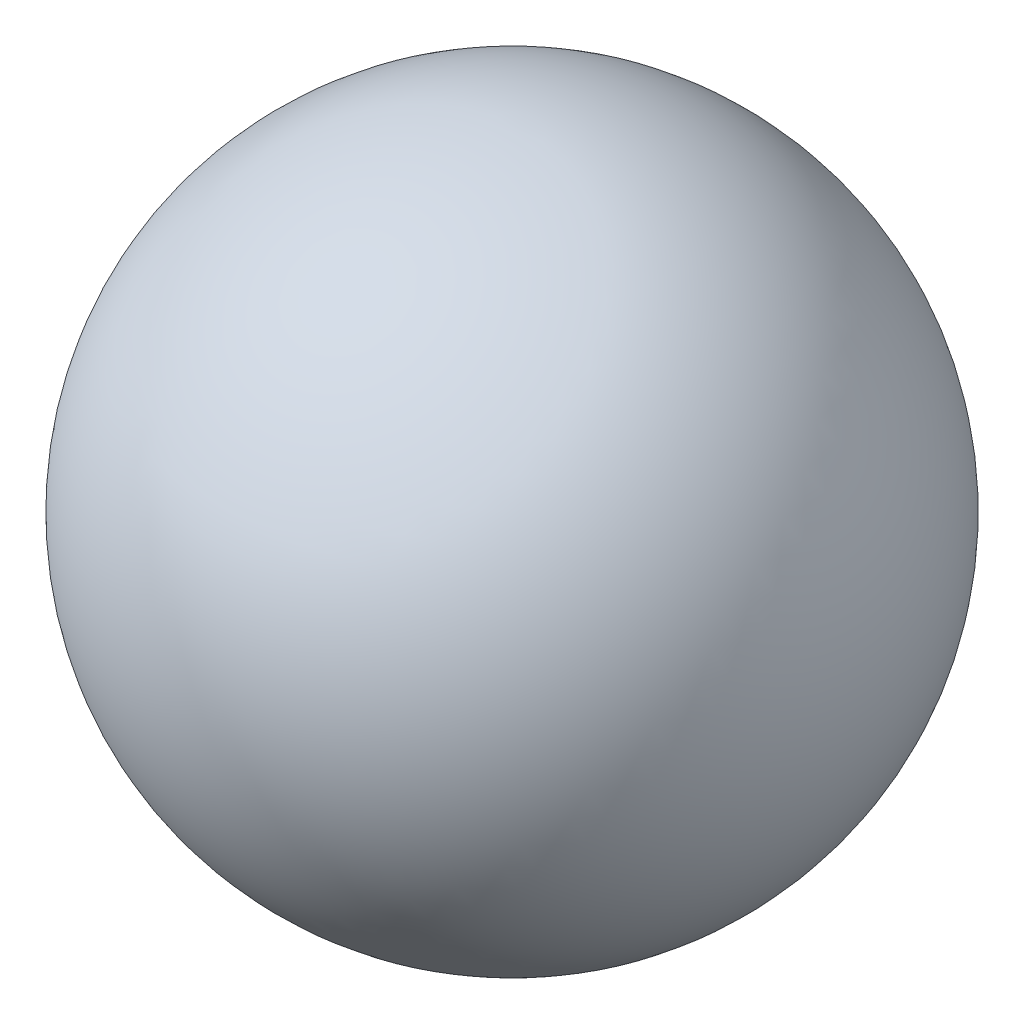
ISO-10303-21;
HEADER;
FILE_DESCRIPTION(('STEP AP214'),'2;1');
FILE_NAME('part.step','',(''),(''),'','','');
FILE_SCHEMA(('AUTOMOTIVE_DESIGN { 1 0 10303 214 1 1 1 1 }'));
ENDSEC;
DATA;
#1=APPLICATION_CONTEXT('core data for automotive mechanical design processes');
#2=APPLICATION_PROTOCOL_DEFINITION('international standard','automotive_design',2000,#1);
#3=PRODUCT_CONTEXT('',#1,'mechanical');
#4=PRODUCT('Part','Part','',(#3));
#5=PRODUCT_RELATED_PRODUCT_CATEGORY('part','',(#4));
#6=PRODUCT_DEFINITION_FORMATION('','',#4);
#7=PRODUCT_DEFINITION_CONTEXT('part definition',#1,'design');
#8=PRODUCT_DEFINITION('design','',#6,#7);
#9=PRODUCT_DEFINITION_SHAPE('','',#8);
#10=(LENGTH_UNIT() NAMED_UNIT(*) SI_UNIT(.MILLI.,.METRE.));
#11=(NAMED_UNIT(*) PLANE_ANGLE_UNIT() SI_UNIT($,.RADIAN.));
#12=(NAMED_UNIT(*) SI_UNIT($,.STERADIAN.) SOLID_ANGLE_UNIT());
#13=UNCERTAINTY_MEASURE_WITH_UNIT(LENGTH_MEASURE(1.E-05),#10,'distance_accuracy_value','');
#14=(GEOMETRIC_REPRESENTATION_CONTEXT(3) GLOBAL_UNCERTAINTY_ASSIGNED_CONTEXT((#13)) GLOBAL_UNIT_ASSIGNED_CONTEXT((#10,
#11,#12)) REPRESENTATION_CONTEXT('',''));
#15=CARTESIAN_POINT('',(0.,0.,0.));
#16=DIRECTION('',(0.,0.,1.));
#17=DIRECTION('',(1.,0.,0.));
#18=AXIS2_PLACEMENT_3D('',#15,#16,#17);
#19=CARTESIAN_POINT('',(2.5,10.75,0.));
#20=DIRECTION('',(0.,-1.,0.));
#21=DIRECTION('',(0.,0.,-1.));
#22=AXIS2_PLACEMENT_3D('',#19,#20,#21);
#23=SPHERICAL_SURFACE('',#22,1.1905);
#24=CARTESIAN_POINT('',(2.5,11.9405,0.));
#25=VERTEX_POINT('',#24);
#26=VERTEX_LOOP('',#25);
#27=FACE_BOUND('',#26,.T.);
#28=CARTESIAN_POINT('',(2.5,9.5595,0.));
#29=VERTEX_POINT('',#28);
#30=VERTEX_LOOP('',#29);
#31=FACE_BOUND('',#30,.T.);
#32=ADVANCED_FACE('F15',(#27,#31),#23,.T.);
#33=CLOSED_SHELL('',(#32));
#34=MANIFOLD_SOLID_BREP('B1',#33);
#35=ADVANCED_BREP_SHAPE_REPRESENTATION('',(#18,#34),#14);
#36=SHAPE_DEFINITION_REPRESENTATION(#9,#35);
ENDSEC;
END-ISO-10303-21;
